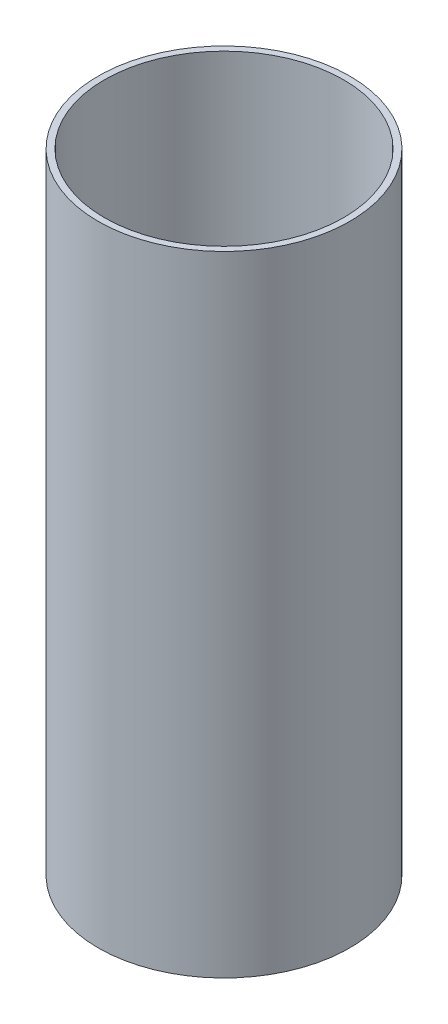
ISO-10303-21;
HEADER;
FILE_DESCRIPTION(('STEP AP214'),'2;1');
FILE_NAME('part.step','',(''),(''),'','','');
FILE_SCHEMA(('AUTOMOTIVE_DESIGN { 1 0 10303 214 1 1 1 1 }'));
ENDSEC;
DATA;
#1=APPLICATION_CONTEXT('core data for automotive mechanical design processes');
#2=APPLICATION_PROTOCOL_DEFINITION('international standard','automotive_design',2000,#1);
#3=PRODUCT_CONTEXT('',#1,'mechanical');
#4=PRODUCT('Part','Part','',(#3));
#5=PRODUCT_RELATED_PRODUCT_CATEGORY('part','',(#4));
#6=PRODUCT_DEFINITION_FORMATION('','',#4);
#7=PRODUCT_DEFINITION_CONTEXT('part definition',#1,'design');
#8=PRODUCT_DEFINITION('design','',#6,#7);
#9=PRODUCT_DEFINITION_SHAPE('','',#8);
#10=(LENGTH_UNIT() NAMED_UNIT(*) SI_UNIT(.MILLI.,.METRE.));
#11=(NAMED_UNIT(*) PLANE_ANGLE_UNIT() SI_UNIT($,.RADIAN.));
#12=(NAMED_UNIT(*) SI_UNIT($,.STERADIAN.) SOLID_ANGLE_UNIT());
#13=UNCERTAINTY_MEASURE_WITH_UNIT(LENGTH_MEASURE(1.E-05),#10,'distance_accuracy_value','');
#14=(GEOMETRIC_REPRESENTATION_CONTEXT(3) GLOBAL_UNCERTAINTY_ASSIGNED_CONTEXT((#13)) GLOBAL_UNIT_ASSIGNED_CONTEXT((#10,
#11,#12)) REPRESENTATION_CONTEXT('',''));
#15=CARTESIAN_POINT('',(0.,0.,0.));
#16=DIRECTION('',(0.,0.,1.));
#17=DIRECTION('',(1.,0.,0.));
#18=AXIS2_PLACEMENT_3D('',#15,#16,#17);
#19=CARTESIAN_POINT('',(0.,200.,0.));
#20=DIRECTION('',(0.,1.,0.));
#21=DIRECTION('',(0.,0.,1.));
#22=AXIS2_PLACEMENT_3D('',#19,#20,#21);
#23=PLANE('',#22);
#24=CARTESIAN_POINT('',(0.,200.,0.));
#25=DIRECTION('',(0.,1.,0.));
#26=DIRECTION('',(0.,0.,1.));
#27=AXIS2_PLACEMENT_3D('',#24,#25,#26);
#28=CIRCLE('',#27,40.);
#29=CARTESIAN_POINT('',(0.,200.,40.));
#30=VERTEX_POINT('',#29);
#31=EDGE_CURVE('E10',#30,#30,#28,.T.);
#32=ORIENTED_EDGE('',*,*,#31,.T.);
#33=EDGE_LOOP('',(#32));
#34=FACE_BOUND('',#33,.T.);
#35=CARTESIAN_POINT('',(0.,200.,0.));
#36=DIRECTION('',(0.,1.,0.));
#37=DIRECTION('',(0.,0.,1.));
#38=AXIS2_PLACEMENT_3D('',#35,#36,#37);
#39=CIRCLE('',#38,38.);
#40=CARTESIAN_POINT('',(0.,200.,38.));
#41=VERTEX_POINT('',#40);
#42=EDGE_CURVE('E46',#41,#41,#39,.T.);
#43=ORIENTED_EDGE('',*,*,#42,.F.);
#44=EDGE_LOOP('',(#43));
#45=FACE_BOUND('',#44,.T.);
#46=ADVANCED_FACE('F35',(#34,#45),#23,.T.);
#47=CARTESIAN_POINT('',(0.,0.,0.));
#48=DIRECTION('',(0.,1.,0.));
#49=DIRECTION('',(0.,0.,1.));
#50=AXIS2_PLACEMENT_3D('',#47,#48,#49);
#51=PLANE('',#50);
#52=CARTESIAN_POINT('',(0.,0.,0.));
#53=DIRECTION('',(0.,1.,0.));
#54=DIRECTION('',(0.,0.,1.));
#55=AXIS2_PLACEMENT_3D('',#52,#53,#54);
#56=CIRCLE('',#55,40.);
#57=CARTESIAN_POINT('',(0.,0.,40.));
#58=VERTEX_POINT('',#57);
#59=EDGE_CURVE('E39',#58,#58,#56,.T.);
#60=ORIENTED_EDGE('',*,*,#59,.F.);
#61=EDGE_LOOP('',(#60));
#62=FACE_BOUND('',#61,.T.);
#63=CARTESIAN_POINT('',(0.,0.,0.));
#64=DIRECTION('',(0.,1.,0.));
#65=DIRECTION('',(0.,0.,1.));
#66=AXIS2_PLACEMENT_3D('',#63,#64,#65);
#67=CIRCLE('',#66,38.);
#68=CARTESIAN_POINT('',(0.,0.,38.));
#69=VERTEX_POINT('',#68);
#70=EDGE_CURVE('E48',#69,#69,#67,.T.);
#71=ORIENTED_EDGE('',*,*,#70,.T.);
#72=EDGE_LOOP('',(#71));
#73=FACE_BOUND('',#72,.T.);
#74=ADVANCED_FACE('F58',(#62,#73),#51,.F.);
#75=CARTESIAN_POINT('',(0.,200.,0.));
#76=DIRECTION('',(0.,-1.,0.));
#77=DIRECTION('',(0.,0.,-1.));
#78=AXIS2_PLACEMENT_3D('',#75,#76,#77);
#79=CYLINDRICAL_SURFACE('',#78,40.);
#80=ORIENTED_EDGE('',*,*,#31,.F.);
#81=EDGE_LOOP('',(#80));
#82=FACE_BOUND('',#81,.T.);
#83=ORIENTED_EDGE('',*,*,#59,.T.);
#84=EDGE_LOOP('',(#83));
#85=FACE_BOUND('',#84,.T.);
#86=ADVANCED_FACE('F37',(#82,#85),#79,.T.);
#87=CARTESIAN_POINT('',(0.,200.,0.));
#88=DIRECTION('',(0.,-1.,0.));
#89=DIRECTION('',(0.,0.,-1.));
#90=AXIS2_PLACEMENT_3D('',#87,#88,#89);
#91=CYLINDRICAL_SURFACE('',#90,38.);
#92=ORIENTED_EDGE('',*,*,#42,.T.);
#93=EDGE_LOOP('',(#92));
#94=FACE_BOUND('',#93,.T.);
#95=ORIENTED_EDGE('',*,*,#70,.F.);
#96=EDGE_LOOP('',(#95));
#97=FACE_BOUND('',#96,.T.);
#98=ADVANCED_FACE('F54',(#94,#97),#91,.F.);
#99=CLOSED_SHELL('',(#46,#74,#86,#98));
#100=MANIFOLD_SOLID_BREP('B2',#99);
#101=ADVANCED_BREP_SHAPE_REPRESENTATION('',(#18,#100),#14);
#102=SHAPE_DEFINITION_REPRESENTATION(#9,#101);
ENDSEC;
END-ISO-10303-21;
